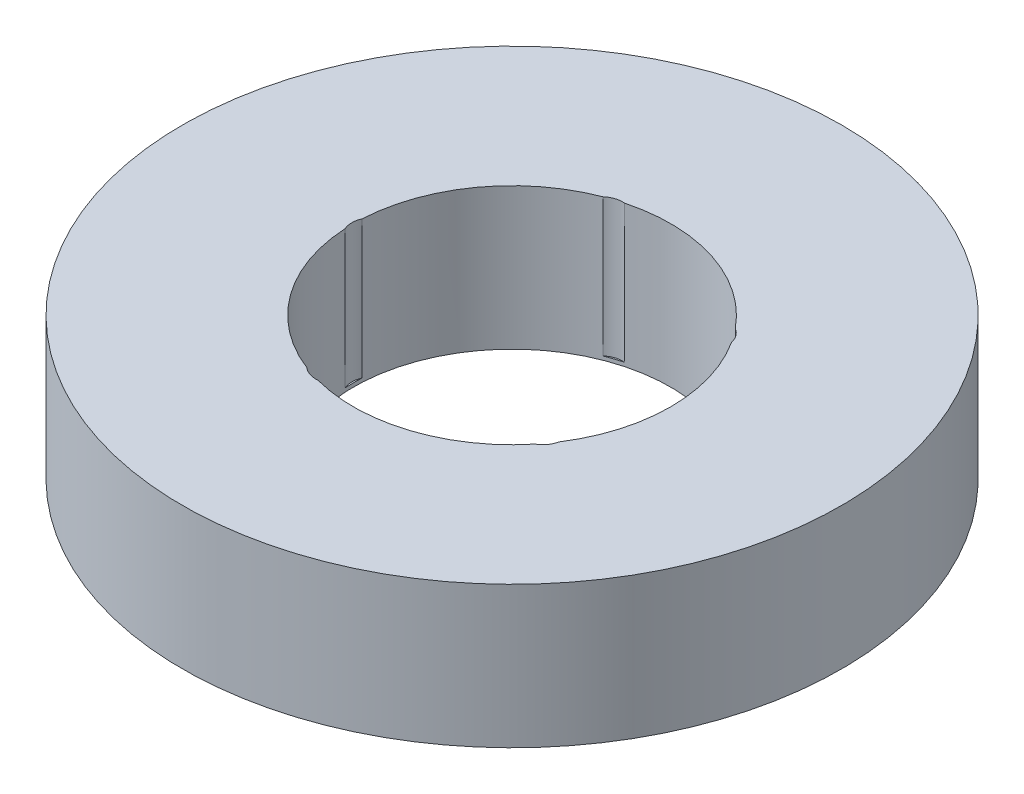
ISO-10303-21;
HEADER;
FILE_DESCRIPTION(('STEP AP214'),'2;1');
FILE_NAME('part.step','',(''),(''),'','','');
FILE_SCHEMA(('AUTOMOTIVE_DESIGN { 1 0 10303 214 1 1 1 1 }'));
ENDSEC;
DATA;
#1=APPLICATION_CONTEXT('core data for automotive mechanical design processes');
#2=APPLICATION_PROTOCOL_DEFINITION('international standard','automotive_design',2000,#1);
#3=PRODUCT_CONTEXT('',#1,'mechanical');
#4=PRODUCT('Part','Part','',(#3));
#5=PRODUCT_RELATED_PRODUCT_CATEGORY('part','',(#4));
#6=PRODUCT_DEFINITION_FORMATION('','',#4);
#7=PRODUCT_DEFINITION_CONTEXT('part definition',#1,'design');
#8=PRODUCT_DEFINITION('design','',#6,#7);
#9=PRODUCT_DEFINITION_SHAPE('','',#8);
#10=(LENGTH_UNIT() NAMED_UNIT(*) SI_UNIT(.MILLI.,.METRE.));
#11=(NAMED_UNIT(*) PLANE_ANGLE_UNIT() SI_UNIT($,.RADIAN.));
#12=(NAMED_UNIT(*) SI_UNIT($,.STERADIAN.) SOLID_ANGLE_UNIT());
#13=UNCERTAINTY_MEASURE_WITH_UNIT(LENGTH_MEASURE(1.E-05),#10,'distance_accuracy_value','');
#14=(GEOMETRIC_REPRESENTATION_CONTEXT(3) GLOBAL_UNCERTAINTY_ASSIGNED_CONTEXT((#13)) GLOBAL_UNIT_ASSIGNED_CONTEXT((#10,
#11,#12)) REPRESENTATION_CONTEXT('',''));
#15=CARTESIAN_POINT('',(0.,0.,0.));
#16=DIRECTION('',(0.,0.,1.));
#17=DIRECTION('',(1.,0.,0.));
#18=AXIS2_PLACEMENT_3D('',#15,#16,#17);
#19=CARTESIAN_POINT('',(0.,29.,0.));
#20=DIRECTION('',(0.,-1.,0.));
#21=DIRECTION('',(0.,0.,-1.));
#22=AXIS2_PLACEMENT_3D('',#19,#20,#21);
#23=CYLINDRICAL_SURFACE('',#22,67.5);
#24=CARTESIAN_POINT('',(0.,29.,0.));
#25=DIRECTION('',(0.,1.,0.));
#26=DIRECTION('',(0.,0.,1.));
#27=AXIS2_PLACEMENT_3D('',#24,#25,#26);
#28=CIRCLE('',#27,67.5);
#29=CARTESIAN_POINT('',(0.,29.,-67.5));
#30=VERTEX_POINT('',#29);
#31=EDGE_CURVE('E159',#30,#30,#28,.T.);
#32=CARTESIAN_POINT('',(0.,0.,0.));
#33=DIRECTION('',(0.,1.,0.));
#34=DIRECTION('',(0.,0.,1.));
#35=AXIS2_PLACEMENT_3D('',#32,#33,#34);
#36=CIRCLE('',#35,67.5);
#37=CARTESIAN_POINT('',(0.,0.,-67.5));
#38=VERTEX_POINT('',#37);
#39=EDGE_CURVE('E152',#38,#38,#36,.T.);
#40=CARTESIAN_POINT('',(0.,29.,-67.5));
#41=CARTESIAN_POINT('',(0.,28.6979166666667,-67.5));
#42=CARTESIAN_POINT('',(0.,28.3958333333333,-67.5));
#43=CARTESIAN_POINT('',(0.,27.7916666666667,-67.5));
#44=CARTESIAN_POINT('',(0.,27.4895833333333,-67.5));
#45=CARTESIAN_POINT('',(0.,26.8854166666667,-67.5));
#46=CARTESIAN_POINT('',(0.,26.5833333333333,-67.5));
#47=CARTESIAN_POINT('',(0.,25.9791666666667,-67.5));
#48=CARTESIAN_POINT('',(0.,25.6770833333333,-67.5));
#49=CARTESIAN_POINT('',(0.,25.0729166666667,-67.5));
#50=CARTESIAN_POINT('',(0.,24.7708333333333,-67.5));
#51=CARTESIAN_POINT('',(0.,24.1666666666667,-67.5));
#52=CARTESIAN_POINT('',(0.,23.8645833333333,-67.5));
#53=CARTESIAN_POINT('',(0.,23.2604166666667,-67.5));
#54=CARTESIAN_POINT('',(0.,22.9583333333333,-67.5));
#55=CARTESIAN_POINT('',(0.,22.3541666666667,-67.5));
#56=CARTESIAN_POINT('',(0.,22.0520833333333,-67.5));
#57=CARTESIAN_POINT('',(0.,21.4479166666667,-67.5));
#58=CARTESIAN_POINT('',(0.,21.1458333333333,-67.5));
#59=CARTESIAN_POINT('',(0.,20.5416666666667,-67.5));
#60=CARTESIAN_POINT('',(0.,20.2395833333333,-67.5));
#61=CARTESIAN_POINT('',(0.,19.6354166666667,-67.5));
#62=CARTESIAN_POINT('',(0.,19.3333333333333,-67.5));
#63=CARTESIAN_POINT('',(0.,18.7291666666667,-67.5));
#64=CARTESIAN_POINT('',(0.,18.4270833333333,-67.5));
#65=CARTESIAN_POINT('',(0.,17.8229166666667,-67.5));
#66=CARTESIAN_POINT('',(0.,17.5208333333333,-67.5));
#67=CARTESIAN_POINT('',(0.,16.9166666666667,-67.5));
#68=CARTESIAN_POINT('',(0.,16.6145833333333,-67.5));
#69=CARTESIAN_POINT('',(0.,16.0104166666667,-67.5));
#70=CARTESIAN_POINT('',(0.,15.7083333333333,-67.5));
#71=CARTESIAN_POINT('',(0.,15.1041666666667,-67.5));
#72=CARTESIAN_POINT('',(0.,14.8020833333333,-67.5));
#73=CARTESIAN_POINT('',(0.,14.1979166666667,-67.5));
#74=CARTESIAN_POINT('',(0.,13.8958333333333,-67.5));
#75=CARTESIAN_POINT('',(0.,13.2916666666667,-67.5));
#76=CARTESIAN_POINT('',(0.,12.9895833333333,-67.5));
#77=CARTESIAN_POINT('',(0.,12.3854166666667,-67.5));
#78=CARTESIAN_POINT('',(0.,12.0833333333333,-67.5));
#79=CARTESIAN_POINT('',(0.,11.4791666666667,-67.5));
#80=CARTESIAN_POINT('',(0.,11.1770833333333,-67.5));
#81=CARTESIAN_POINT('',(0.,10.5729166666667,-67.5));
#82=CARTESIAN_POINT('',(0.,10.2708333333333,-67.5));
#83=CARTESIAN_POINT('',(0.,9.66666666666667,-67.5));
#84=CARTESIAN_POINT('',(0.,9.36458333333333,-67.5));
#85=CARTESIAN_POINT('',(0.,8.76041666666667,-67.5));
#86=CARTESIAN_POINT('',(0.,8.45833333333333,-67.5));
#87=CARTESIAN_POINT('',(0.,7.85416666666667,-67.5));
#88=CARTESIAN_POINT('',(0.,7.55208333333333,-67.5));
#89=CARTESIAN_POINT('',(0.,6.94791666666667,-67.5));
#90=CARTESIAN_POINT('',(0.,6.64583333333333,-67.5));
#91=CARTESIAN_POINT('',(0.,6.04166666666667,-67.5));
#92=CARTESIAN_POINT('',(0.,5.73958333333333,-67.5));
#93=CARTESIAN_POINT('',(0.,5.13541666666667,-67.5));
#94=CARTESIAN_POINT('',(0.,4.83333333333333,-67.5));
#95=CARTESIAN_POINT('',(0.,4.22916666666667,-67.5));
#96=CARTESIAN_POINT('',(0.,3.92708333333333,-67.5));
#97=CARTESIAN_POINT('',(0.,3.32291666666667,-67.5));
#98=CARTESIAN_POINT('',(0.,3.02083333333333,-67.5));
#99=CARTESIAN_POINT('',(0.,2.41666666666667,-67.5));
#100=CARTESIAN_POINT('',(0.,2.11458333333333,-67.5));
#101=CARTESIAN_POINT('',(0.,1.51041666666667,-67.5));
#102=CARTESIAN_POINT('',(0.,1.20833333333333,-67.5));
#103=CARTESIAN_POINT('',(0.,0.604166666666667,-67.5));
#104=CARTESIAN_POINT('',(0.,0.302083333333333,-67.5));
#105=CARTESIAN_POINT('',(0.,0.,-67.5));
#106=B_SPLINE_CURVE_WITH_KNOTS('',3,(#40,#41,#42,#43,#44,#45,#46,#47,#48,#49,#50,#51,#52,#53,
#54,#55,#56,#57,#58,#59,#60,#61,#62,#63,#64,#65,#66,#67,#68,#69,#70,#71,#72,#73,#74,#75,#76,#77,
#78,#79,#80,#81,#82,#83,#84,#85,#86,#87,#88,#89,#90,#91,#92,#93,#94,#95,#96,#97,#98,#99,#100,
#101,#102,#103,#104,#105),.UNSPECIFIED.,.F.,.F.,(4,2,2,2,2,2,2,2,2,2,2,2,2,2,2,2,2,2,2,2,2,2,2,
2,2,2,2,2,2,2,2,2,4),(0.,0.906249999999997,1.8125,2.71875,3.625,4.53125,5.4375,6.34375,7.25,
8.15625,9.0625,9.96875,10.875,11.78125,12.6875,13.59375,14.5,15.40625,16.3125,17.21875,18.125,
19.03125,19.9375,20.84375,21.75,22.65625,23.5625,24.46875,25.375,26.28125,27.1875,28.09375,29.),.UNSPECIFIED.);
#107=EDGE_CURVE('BSEAM39',#30,#38,#106,.T.);
#108=ORIENTED_EDGE('',*,*,#31,.F.);
#109=ORIENTED_EDGE('',*,*,#39,.T.);
#110=ORIENTED_EDGE('',*,*,#107,.T.);
#111=ORIENTED_EDGE('',*,*,#107,.F.);
#112=EDGE_LOOP('',(#108,#110,#109,#111));
#113=FACE_BOUND('',#112,.T.);
#114=ADVANCED_FACE('F39',(#113),#23,.T.);
#115=CARTESIAN_POINT('',(0.,29.,0.));
#116=DIRECTION('',(0.,1.,0.));
#117=DIRECTION('',(0.,0.,1.));
#118=AXIS2_PLACEMENT_3D('',#115,#116,#117);
#119=PLANE('',#118);
#120=CARTESIAN_POINT('',(-8.78633247370417,29.,27.0415508064679));
#121=DIRECTION('',(0.,1.,0.));
#122=DIRECTION('',(0.951056516295155,0.,0.309016994374945));
#123=AXIS2_PLACEMENT_3D('',#120,#121,#122);
#124=CIRCLE('',#123,4.38640503994593);
#125=CARTESIAN_POINT('',(-11.698978165452,29.,30.3213441305671));
#126=VERTEX_POINT('',#125);
#127=CARTESIAN_POINT('',(-8.35776675696,29.,31.4069695264643));
#128=VERTEX_POINT('',#127);
#129=EDGE_CURVE('E192',#126,#128,#124,.T.);
#130=ORIENTED_EDGE('',*,*,#129,.F.);
#131=CARTESIAN_POINT('',(0.,29.,0.));
#132=DIRECTION('',(0.,1.,0.));
#133=DIRECTION('',(0.,0.,1.));
#134=AXIS2_PLACEMENT_3D('',#131,#132,#133);
#135=CIRCLE('',#134,32.5);
#136=CARTESIAN_POINT('',(-32.4524949881498,29.,1.75657878961163));
#137=VERTEX_POINT('',#136);
#138=EDGE_CURVE('E147',#137,#126,#135,.T.);
#139=ORIENTED_EDGE('',*,*,#138,.F.);
#140=CARTESIAN_POINT('',(-28.4331691578208,29.,0.));
#141=DIRECTION('',(0.,1.,0.));
#142=DIRECTION('',(0.,0.,1.));
#143=AXIS2_PLACEMENT_3D('',#140,#141,#142);
#144=CIRCLE('',#143,4.38640503994593);
#145=CARTESIAN_POINT('',(-32.4524949881498,29.,-1.75657878961163));
#146=VERTEX_POINT('',#145);
#147=EDGE_CURVE('E154',#146,#137,#144,.T.);
#148=ORIENTED_EDGE('',*,*,#147,.F.);
#149=CARTESIAN_POINT('',(-11.6989781654524,29.,-30.321344130567));
#150=VERTEX_POINT('',#149);
#151=EDGE_CURVE('E136',#150,#146,#135,.T.);
#152=ORIENTED_EDGE('',*,*,#151,.F.);
#153=CARTESIAN_POINT('',(-8.78633247370455,29.,-27.0415508064678));
#154=DIRECTION('',(0.,1.,0.));
#155=DIRECTION('',(-0.95105651629515,0.,0.309016994374958));
#156=AXIS2_PLACEMENT_3D('',#153,#154,#155);
#157=CIRCLE('',#156,4.38640503994593);
#158=CARTESIAN_POINT('',(-8.35776675696045,29.,-31.4069695264641));
#159=VERTEX_POINT('',#158);
#160=EDGE_CURVE('E117',#159,#150,#157,.T.);
#161=ORIENTED_EDGE('',*,*,#160,.F.);
#162=CARTESIAN_POINT('',(25.2221288482573,29.,-20.4962000468844));
#163=VERTEX_POINT('',#162);
#164=EDGE_CURVE('E133',#163,#159,#135,.T.);
#165=ORIENTED_EDGE('',*,*,#164,.F.);
#166=CARTESIAN_POINT('',(23.0029170526145,29.,-16.7125975069045));
#167=DIRECTION('',(0.,1.,0.));
#168=DIRECTION('',(-0.58778525229248,0.,-0.809016994374942));
#169=AXIS2_PLACEMENT_3D('',#166,#167,#168);
#170=CIRCLE('',#169,4.38640503994593);
#171=CARTESIAN_POINT('',(27.2871110623043,29.,-17.6539958613757));
#172=VERTEX_POINT('',#171);
#173=EDGE_CURVE('E333',#172,#163,#170,.T.);
#174=ORIENTED_EDGE('',*,*,#173,.F.);
#175=CARTESIAN_POINT('',(27.2871110623046,29.,17.6539958613753));
#176=VERTEX_POINT('',#175);
#177=EDGE_CURVE('E144',#176,#172,#135,.T.);
#178=ORIENTED_EDGE('',*,*,#177,.F.);
#179=CARTESIAN_POINT('',(23.0029170526148,29.,16.7125975069041));
#180=DIRECTION('',(0.,1.,0.));
#181=DIRECTION('',(0.587785252292469,0.,-0.809016994374951));
#182=AXIS2_PLACEMENT_3D('',#179,#180,#181);
#183=CIRCLE('',#182,4.38640503994593);
#184=CARTESIAN_POINT('',(25.2221288482576,29.,20.4962000468841));
#185=VERTEX_POINT('',#184);
#186=EDGE_CURVE('E328',#185,#176,#183,.T.);
#187=ORIENTED_EDGE('',*,*,#186,.F.);
#188=EDGE_CURVE('E146',#128,#185,#135,.T.);
#189=ORIENTED_EDGE('',*,*,#188,.F.);
#190=EDGE_LOOP('',(#130,#139,#148,#152,#161,#165,#174,#178,#187,#189));
#191=FACE_BOUND('',#190,.T.);
#192=ORIENTED_EDGE('',*,*,#31,.T.);
#193=EDGE_LOOP('',(#192));
#194=FACE_BOUND('',#193,.T.);
#195=ADVANCED_FACE('F131',(#191,#194),#119,.T.);
#196=CARTESIAN_POINT('',(0.,0.,0.));
#197=DIRECTION('',(0.,1.,0.));
#198=DIRECTION('',(0.,0.,1.));
#199=AXIS2_PLACEMENT_3D('',#196,#197,#198);
#200=PLANE('',#199);
#201=CARTESIAN_POINT('',(0.,0.,0.));
#202=DIRECTION('',(0.,1.,0.));
#203=DIRECTION('',(0.,0.,1.));
#204=AXIS2_PLACEMENT_3D('',#201,#202,#203);
#205=CIRCLE('',#204,32.5);
#206=CARTESIAN_POINT('',(0.,0.,32.5));
#207=VERTEX_POINT('',#206);
#208=EDGE_CURVE('E149',#207,#207,#205,.T.);
#209=ORIENTED_EDGE('',*,*,#208,.T.);
#210=EDGE_LOOP('',(#209));
#211=FACE_BOUND('',#210,.T.);
#212=ORIENTED_EDGE('',*,*,#39,.F.);
#213=EDGE_LOOP('',(#212));
#214=FACE_BOUND('',#213,.T.);
#215=ADVANCED_FACE('F209',(#211,#214),#200,.F.);
#216=CARTESIAN_POINT('',(0.,29.,0.));
#217=DIRECTION('',(0.,-1.,0.));
#218=DIRECTION('',(0.,0.,-1.));
#219=AXIS2_PLACEMENT_3D('',#216,#217,#218);
#220=CYLINDRICAL_SURFACE('',#219,32.5);
#221=DIRECTION('',(0.,1.,0.));
#222=VECTOR('',#221,1.);
#223=CARTESIAN_POINT('',(-11.698978165452,14.8818974344439,30.3213441305671));
#224=LINE('',#223,#222);
#225=CARTESIAN_POINT('',(-11.698978165452,0.763794868887748,30.3213441305671));
#226=VERTEX_POINT('',#225);
#227=EDGE_CURVE('E11',#226,#126,#224,.T.);
#228=ORIENTED_EDGE('',*,*,#227,.F.);
#229=CARTESIAN_POINT('',(0.,0.763794868887748,0.));
#230=DIRECTION('',(0.,1.,0.));
#231=DIRECTION('',(0.,0.,1.));
#232=AXIS2_PLACEMENT_3D('',#229,#230,#231);
#233=CIRCLE('',#232,32.5);
#234=CARTESIAN_POINT('',(-8.35776675696,0.763794868887748,31.4069695264643));
#235=VERTEX_POINT('',#234);
#236=EDGE_CURVE('E187',#226,#235,#233,.T.);
#237=ORIENTED_EDGE('',*,*,#236,.T.);
#238=DIRECTION('',(0.,1.,0.));
#239=VECTOR('',#238,1.);
#240=CARTESIAN_POINT('',(-8.35776675696003,14.8818974344439,31.4069695264643));
#241=LINE('',#240,#239);
#242=EDGE_CURVE('E46',#128,#235,#241,.F.);
#243=ORIENTED_EDGE('',*,*,#242,.F.);
#244=ORIENTED_EDGE('',*,*,#188,.T.);
#245=DIRECTION('',(0.,1.,0.));
#246=VECTOR('',#245,1.);
#247=CARTESIAN_POINT('',(25.2221288482576,14.8818974344439,20.4962000468841));
#248=LINE('',#247,#246);
#249=CARTESIAN_POINT('',(25.2221288482576,0.763794868887748,20.4962000468841));
#250=VERTEX_POINT('',#249);
#251=EDGE_CURVE('E186',#250,#185,#248,.T.);
#252=ORIENTED_EDGE('',*,*,#251,.F.);
#253=CARTESIAN_POINT('',(0.,0.763794868887748,0.));
#254=DIRECTION('',(0.,1.,0.));
#255=DIRECTION('',(0.,0.,1.));
#256=AXIS2_PLACEMENT_3D('',#253,#254,#255);
#257=CIRCLE('',#256,32.5);
#258=CARTESIAN_POINT('',(27.2871110623046,0.763794868887748,17.6539958613753));
#259=VERTEX_POINT('',#258);
#260=EDGE_CURVE('E182',#250,#259,#257,.T.);
#261=ORIENTED_EDGE('',*,*,#260,.T.);
#262=DIRECTION('',(0.,1.,0.));
#263=VECTOR('',#262,1.);
#264=CARTESIAN_POINT('',(27.2871110623046,14.8818974344439,17.6539958613753));
#265=LINE('',#264,#263);
#266=EDGE_CURVE('E184',#176,#259,#265,.F.);
#267=ORIENTED_EDGE('',*,*,#266,.F.);
#268=ORIENTED_EDGE('',*,*,#177,.T.);
#269=DIRECTION('',(0.,1.,0.));
#270=VECTOR('',#269,1.);
#271=CARTESIAN_POINT('',(27.2871110623043,14.8818974344439,-17.6539958613757));
#272=LINE('',#271,#270);
#273=CARTESIAN_POINT('',(27.2871110623043,0.763794868887748,-17.6539958613757));
#274=VERTEX_POINT('',#273);
#275=EDGE_CURVE('E178',#274,#172,#272,.T.);
#276=ORIENTED_EDGE('',*,*,#275,.F.);
#277=CARTESIAN_POINT('',(0.,0.763794868887748,0.));
#278=DIRECTION('',(0.,1.,0.));
#279=DIRECTION('',(0.,0.,1.));
#280=AXIS2_PLACEMENT_3D('',#277,#278,#279);
#281=CIRCLE('',#280,32.5);
#282=CARTESIAN_POINT('',(25.2221288482573,0.763794868887748,-20.4962000468844));
#283=VERTEX_POINT('',#282);
#284=EDGE_CURVE('E123',#274,#283,#281,.T.);
#285=ORIENTED_EDGE('',*,*,#284,.T.);
#286=DIRECTION('',(0.,1.,0.));
#287=VECTOR('',#286,1.);
#288=CARTESIAN_POINT('',(25.2221288482573,14.8818974344439,-20.4962000468844));
#289=LINE('',#288,#287);
#290=EDGE_CURVE('E145',#163,#283,#289,.F.);
#291=ORIENTED_EDGE('',*,*,#290,.F.);
#292=ORIENTED_EDGE('',*,*,#164,.T.);
#293=DIRECTION('',(0.,1.,0.));
#294=VECTOR('',#293,1.);
#295=CARTESIAN_POINT('',(-8.35776675696048,14.8818974344439,-31.4069695264641));
#296=LINE('',#295,#294);
#297=CARTESIAN_POINT('',(-8.35776675696045,0.763794868887748,-31.4069695264641));
#298=VERTEX_POINT('',#297);
#299=EDGE_CURVE('E111',#298,#159,#296,.T.);
#300=ORIENTED_EDGE('',*,*,#299,.F.);
#301=CARTESIAN_POINT('',(0.,0.763794868887748,0.));
#302=DIRECTION('',(0.,1.,0.));
#303=DIRECTION('',(0.,0.,1.));
#304=AXIS2_PLACEMENT_3D('',#301,#302,#303);
#305=CIRCLE('',#304,32.5);
#306=CARTESIAN_POINT('',(-11.6989781654524,0.763794868887748,-30.321344130567));
#307=VERTEX_POINT('',#306);
#308=EDGE_CURVE('E173',#298,#307,#305,.T.);
#309=ORIENTED_EDGE('',*,*,#308,.T.);
#310=DIRECTION('',(0.,1.,0.));
#311=VECTOR('',#310,1.);
#312=CARTESIAN_POINT('',(-11.6989781654524,14.8818974344439,-30.321344130567));
#313=LINE('',#312,#311);
#314=EDGE_CURVE('E124',#150,#307,#313,.F.);
#315=ORIENTED_EDGE('',*,*,#314,.F.);
#316=ORIENTED_EDGE('',*,*,#151,.T.);
#317=DIRECTION('',(0.,1.,0.));
#318=VECTOR('',#317,1.);
#319=CARTESIAN_POINT('',(-32.4524949881498,14.8818974344439,-1.75657878961161));
#320=LINE('',#319,#318);
#321=CARTESIAN_POINT('',(-32.4524949881498,0.763794868887748,-1.75657878961163));
#322=VERTEX_POINT('',#321);
#323=EDGE_CURVE('E171',#322,#146,#320,.T.);
#324=ORIENTED_EDGE('',*,*,#323,.F.);
#325=CARTESIAN_POINT('',(0.,0.763794868887748,0.));
#326=DIRECTION('',(0.,1.,0.));
#327=DIRECTION('',(0.,0.,1.));
#328=AXIS2_PLACEMENT_3D('',#325,#326,#327);
#329=CIRCLE('',#328,32.5);
#330=CARTESIAN_POINT('',(-32.4524949881498,0.763794868887748,1.75657878961163));
#331=VERTEX_POINT('',#330);
#332=EDGE_CURVE('E162',#322,#331,#329,.T.);
#333=ORIENTED_EDGE('',*,*,#332,.T.);
#334=DIRECTION('',(0.,1.,0.));
#335=VECTOR('',#334,1.);
#336=CARTESIAN_POINT('',(-32.4524949881498,14.8818974344439,1.75657878961161));
#337=LINE('',#336,#335);
#338=EDGE_CURVE('E169',#137,#331,#337,.F.);
#339=ORIENTED_EDGE('',*,*,#338,.F.);
#340=ORIENTED_EDGE('',*,*,#138,.T.);
#341=EDGE_LOOP('',(#228,#237,#243,#244,#252,#261,#267,#268,#276,#285,#291,#292,#300,#309,#315,
#316,#324,#333,#339,#340));
#342=FACE_BOUND('',#341,.T.);
#343=ORIENTED_EDGE('',*,*,#208,.F.);
#344=EDGE_LOOP('',(#343));
#345=FACE_BOUND('',#344,.T.);
#346=ADVANCED_FACE('F139',(#342,#345),#220,.F.);
#347=CARTESIAN_POINT('',(-28.4331691578208,0.763794868887748,0.));
#348=DIRECTION('',(0.,1.,0.));
#349=DIRECTION('',(0.,0.,1.));
#350=AXIS2_PLACEMENT_3D('',#347,#348,#349);
#351=CYLINDRICAL_SURFACE('',#350,4.38640503994593);
#352=ORIENTED_EDGE('',*,*,#323,.T.);
#353=ORIENTED_EDGE('',*,*,#147,.T.);
#354=ORIENTED_EDGE('',*,*,#338,.T.);
#355=CARTESIAN_POINT('',(-28.4331691578208,0.763794868887748,0.));
#356=DIRECTION('',(0.,1.,0.));
#357=DIRECTION('',(0.,0.,1.));
#358=AXIS2_PLACEMENT_3D('',#355,#356,#357);
#359=CIRCLE('',#358,4.38640503994593);
#360=EDGE_CURVE('E157',#322,#331,#359,.T.);
#361=ORIENTED_EDGE('',*,*,#360,.F.);
#362=EDGE_LOOP('',(#352,#353,#354,#361));
#363=FACE_BOUND('',#362,.T.);
#364=ADVANCED_FACE('F222',(#363),#351,.F.);
#365=CARTESIAN_POINT('',(-28.4331691578208,0.763794868887748,0.));
#366=DIRECTION('',(0.,1.,0.));
#367=DIRECTION('',(0.,0.,1.));
#368=AXIS2_PLACEMENT_3D('',#365,#366,#367);
#369=PLANE('',#368);
#370=ORIENTED_EDGE('',*,*,#360,.T.);
#371=ORIENTED_EDGE('',*,*,#332,.F.);
#372=EDGE_LOOP('',(#370,#371));
#373=FACE_BOUND('',#372,.T.);
#374=ADVANCED_FACE('F223',(#373),#369,.T.);
#375=CARTESIAN_POINT('',(-8.78633247370455,0.763794868887748,-27.0415508064678));
#376=DIRECTION('',(0.,1.,0.));
#377=DIRECTION('',(0.,0.,1.));
#378=AXIS2_PLACEMENT_3D('',#375,#376,#377);
#379=CYLINDRICAL_SURFACE('',#378,4.38640503994593);
#380=ORIENTED_EDGE('',*,*,#299,.T.);
#381=ORIENTED_EDGE('',*,*,#160,.T.);
#382=ORIENTED_EDGE('',*,*,#314,.T.);
#383=CARTESIAN_POINT('',(-8.78633247370455,0.763794868887748,-27.0415508064678));
#384=DIRECTION('',(0.,1.,0.));
#385=DIRECTION('',(-0.95105651629515,0.,0.309016994374958));
#386=AXIS2_PLACEMENT_3D('',#383,#384,#385);
#387=CIRCLE('',#386,4.38640503994593);
#388=EDGE_CURVE('E119',#298,#307,#387,.T.);
#389=ORIENTED_EDGE('',*,*,#388,.F.);
#390=EDGE_LOOP('',(#380,#381,#382,#389));
#391=FACE_BOUND('',#390,.T.);
#392=ADVANCED_FACE('F116',(#391),#379,.F.);
#393=CARTESIAN_POINT('',(-8.78633247370455,0.763794868887748,-27.0415508064678));
#394=DIRECTION('',(0.,1.,0.));
#395=DIRECTION('',(-0.95105651629515,0.,0.309016994374958));
#396=AXIS2_PLACEMENT_3D('',#393,#394,#395);
#397=PLANE('',#396);
#398=ORIENTED_EDGE('',*,*,#388,.T.);
#399=ORIENTED_EDGE('',*,*,#308,.F.);
#400=EDGE_LOOP('',(#398,#399));
#401=FACE_BOUND('',#400,.T.);
#402=ADVANCED_FACE('F235',(#401),#397,.T.);
#403=CARTESIAN_POINT('',(23.0029170526145,0.763794868887748,-16.7125975069045));
#404=DIRECTION('',(0.,1.,0.));
#405=DIRECTION('',(0.,0.,1.));
#406=AXIS2_PLACEMENT_3D('',#403,#404,#405);
#407=CYLINDRICAL_SURFACE('',#406,4.38640503994593);
#408=ORIENTED_EDGE('',*,*,#275,.T.);
#409=ORIENTED_EDGE('',*,*,#173,.T.);
#410=ORIENTED_EDGE('',*,*,#290,.T.);
#411=CARTESIAN_POINT('',(23.0029170526145,0.763794868887748,-16.7125975069045));
#412=DIRECTION('',(0.,1.,0.));
#413=DIRECTION('',(-0.58778525229248,0.,-0.809016994374942));
#414=AXIS2_PLACEMENT_3D('',#411,#412,#413);
#415=CIRCLE('',#414,4.38640503994593);
#416=EDGE_CURVE('E335',#274,#283,#415,.T.);
#417=ORIENTED_EDGE('',*,*,#416,.F.);
#418=EDGE_LOOP('',(#408,#409,#410,#417));
#419=FACE_BOUND('',#418,.T.);
#420=ADVANCED_FACE('F234',(#419),#407,.F.);
#421=CARTESIAN_POINT('',(23.0029170526145,0.763794868887748,-16.7125975069045));
#422=DIRECTION('',(0.,1.,0.));
#423=DIRECTION('',(-0.58778525229248,0.,-0.809016994374942));
#424=AXIS2_PLACEMENT_3D('',#421,#422,#423);
#425=PLANE('',#424);
#426=ORIENTED_EDGE('',*,*,#416,.T.);
#427=ORIENTED_EDGE('',*,*,#284,.F.);
#428=EDGE_LOOP('',(#426,#427));
#429=FACE_BOUND('',#428,.T.);
#430=ADVANCED_FACE('F239',(#429),#425,.T.);
#431=CARTESIAN_POINT('',(23.0029170526148,0.763794868887748,16.7125975069041));
#432=DIRECTION('',(0.,1.,0.));
#433=DIRECTION('',(0.,0.,1.));
#434=AXIS2_PLACEMENT_3D('',#431,#432,#433);
#435=CYLINDRICAL_SURFACE('',#434,4.38640503994593);
#436=ORIENTED_EDGE('',*,*,#251,.T.);
#437=ORIENTED_EDGE('',*,*,#186,.T.);
#438=ORIENTED_EDGE('',*,*,#266,.T.);
#439=CARTESIAN_POINT('',(23.0029170526148,0.763794868887748,16.7125975069041));
#440=DIRECTION('',(0.,1.,0.));
#441=DIRECTION('',(0.587785252292469,0.,-0.809016994374951));
#442=AXIS2_PLACEMENT_3D('',#439,#440,#441);
#443=CIRCLE('',#442,4.38640503994593);
#444=EDGE_CURVE('E56',#250,#259,#443,.T.);
#445=ORIENTED_EDGE('',*,*,#444,.F.);
#446=EDGE_LOOP('',(#436,#437,#438,#445));
#447=FACE_BOUND('',#446,.T.);
#448=ADVANCED_FACE('F242',(#447),#435,.F.);
#449=CARTESIAN_POINT('',(23.0029170526148,0.763794868887748,16.7125975069041));
#450=DIRECTION('',(0.,1.,0.));
#451=DIRECTION('',(0.587785252292469,0.,-0.809016994374951));
#452=AXIS2_PLACEMENT_3D('',#449,#450,#451);
#453=PLANE('',#452);
#454=ORIENTED_EDGE('',*,*,#444,.T.);
#455=ORIENTED_EDGE('',*,*,#260,.F.);
#456=EDGE_LOOP('',(#454,#455));
#457=FACE_BOUND('',#456,.T.);
#458=ADVANCED_FACE('F205',(#457),#453,.T.);
#459=CARTESIAN_POINT('',(-8.78633247370417,0.763794868887748,27.0415508064679));
#460=DIRECTION('',(0.,1.,0.));
#461=DIRECTION('',(0.,0.,1.));
#462=AXIS2_PLACEMENT_3D('',#459,#460,#461);
#463=CYLINDRICAL_SURFACE('',#462,4.38640503994593);
#464=ORIENTED_EDGE('',*,*,#227,.T.);
#465=ORIENTED_EDGE('',*,*,#129,.T.);
#466=ORIENTED_EDGE('',*,*,#242,.T.);
#467=CARTESIAN_POINT('',(-8.78633247370417,0.763794868887748,27.0415508064679));
#468=DIRECTION('',(0.,1.,0.));
#469=DIRECTION('',(0.951056516295155,0.,0.309016994374945));
#470=AXIS2_PLACEMENT_3D('',#467,#468,#469);
#471=CIRCLE('',#470,4.38640503994593);
#472=EDGE_CURVE('E55',#226,#235,#471,.T.);
#473=ORIENTED_EDGE('',*,*,#472,.F.);
#474=EDGE_LOOP('',(#464,#465,#466,#473));
#475=FACE_BOUND('',#474,.T.);
#476=ADVANCED_FACE('F195',(#475),#463,.F.);
#477=CARTESIAN_POINT('',(-8.78633247370417,0.763794868887748,27.0415508064679));
#478=DIRECTION('',(0.,1.,0.));
#479=DIRECTION('',(0.951056516295155,0.,0.309016994374945));
#480=AXIS2_PLACEMENT_3D('',#477,#478,#479);
#481=PLANE('',#480);
#482=ORIENTED_EDGE('',*,*,#472,.T.);
#483=ORIENTED_EDGE('',*,*,#236,.F.);
#484=EDGE_LOOP('',(#482,#483));
#485=FACE_BOUND('',#484,.T.);
#486=ADVANCED_FACE('F198',(#485),#481,.T.);
#487=CLOSED_SHELL('',(#114,#195,#215,#346,#364,#374,#392,#402,#420,#430,#448,#458,#476,#486));
#488=MANIFOLD_SOLID_BREP('B2',#487);
#489=ADVANCED_BREP_SHAPE_REPRESENTATION('',(#18,#488),#14);
#490=SHAPE_DEFINITION_REPRESENTATION(#9,#489);
ENDSEC;
END-ISO-10303-21;
